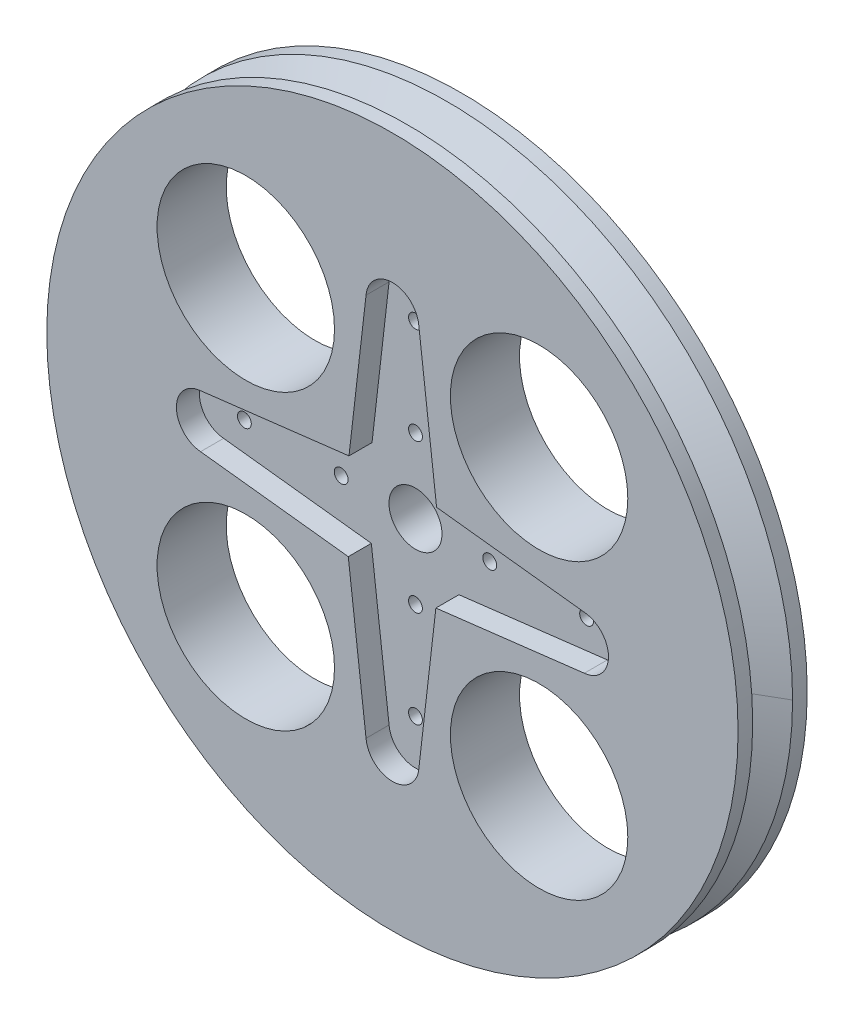
ISO-10303-21;
HEADER;
FILE_DESCRIPTION(('STEP AP214'),'2;1');
FILE_NAME('part.step','',(''),(''),'','','');
FILE_SCHEMA(('AUTOMOTIVE_DESIGN { 1 0 10303 214 1 1 1 1 }'));
ENDSEC;
DATA;
#1=APPLICATION_CONTEXT('core data for automotive mechanical design processes');
#2=APPLICATION_PROTOCOL_DEFINITION('international standard','automotive_design',2000,#1);
#3=PRODUCT_CONTEXT('',#1,'mechanical');
#4=PRODUCT('Part','Part','',(#3));
#5=PRODUCT_RELATED_PRODUCT_CATEGORY('part','',(#4));
#6=PRODUCT_DEFINITION_FORMATION('','',#4);
#7=PRODUCT_DEFINITION_CONTEXT('part definition',#1,'design');
#8=PRODUCT_DEFINITION('design','',#6,#7);
#9=PRODUCT_DEFINITION_SHAPE('','',#8);
#10=(LENGTH_UNIT() NAMED_UNIT(*) SI_UNIT(.MILLI.,.METRE.));
#11=(NAMED_UNIT(*) PLANE_ANGLE_UNIT() SI_UNIT($,.RADIAN.));
#12=(NAMED_UNIT(*) SI_UNIT($,.STERADIAN.) SOLID_ANGLE_UNIT());
#13=UNCERTAINTY_MEASURE_WITH_UNIT(LENGTH_MEASURE(1.E-05),#10,'distance_accuracy_value','');
#14=(GEOMETRIC_REPRESENTATION_CONTEXT(3) GLOBAL_UNCERTAINTY_ASSIGNED_CONTEXT((#13)) GLOBAL_UNIT_ASSIGNED_CONTEXT((#10,
#11,#12)) REPRESENTATION_CONTEXT('',''));
#15=CARTESIAN_POINT('',(0.,0.,0.));
#16=DIRECTION('',(0.,0.,1.));
#17=DIRECTION('',(1.,0.,0.));
#18=AXIS2_PLACEMENT_3D('',#15,#16,#17);
#19=CARTESIAN_POINT('',(0.,0.,-6.));
#20=DIRECTION('',(0.,0.,1.));
#21=DIRECTION('',(1.,0.,0.));
#22=AXIS2_PLACEMENT_3D('',#19,#20,#21);
#23=CYLINDRICAL_SURFACE('',#22,2.30000000000001);
#24=CARTESIAN_POINT('',(0.,0.,-6.));
#25=DIRECTION('',(0.,0.,1.));
#26=DIRECTION('',(1.,0.,0.));
#27=AXIS2_PLACEMENT_3D('',#24,#25,#26);
#28=CIRCLE('',#27,2.30000000000001);
#29=CARTESIAN_POINT('',(2.30000000000002,0.,-6.));
#30=VERTEX_POINT('',#29);
#31=EDGE_CURVE('E324',#30,#30,#28,.T.);
#32=ORIENTED_EDGE('',*,*,#31,.F.);
#33=EDGE_LOOP('',(#32));
#34=FACE_BOUND('',#33,.T.);
#35=CARTESIAN_POINT('',(0.,0.,-2.));
#36=DIRECTION('',(0.,0.,1.));
#37=DIRECTION('',(1.,0.,0.));
#38=AXIS2_PLACEMENT_3D('',#35,#36,#37);
#39=CIRCLE('',#38,2.30000000000001);
#40=CARTESIAN_POINT('',(2.30000000000002,0.,-2.));
#41=VERTEX_POINT('',#40);
#42=EDGE_CURVE('E268',#41,#41,#39,.F.);
#43=ORIENTED_EDGE('',*,*,#42,.F.);
#44=EDGE_LOOP('',(#43));
#45=FACE_BOUND('',#44,.T.);
#46=ADVANCED_FACE('F36',(#34,#45),#23,.F.);
#47=CARTESIAN_POINT('',(-14.85,0.,-6.));
#48=DIRECTION('',(0.,0.,1.));
#49=DIRECTION('',(1.,0.,0.));
#50=AXIS2_PLACEMENT_3D('',#47,#48,#49);
#51=CYLINDRICAL_SURFACE('',#50,0.600000000000013);
#52=CARTESIAN_POINT('',(-14.85,0.,-6.));
#53=DIRECTION('',(0.,0.,1.));
#54=DIRECTION('',(1.,0.,0.));
#55=AXIS2_PLACEMENT_3D('',#52,#53,#54);
#56=CIRCLE('',#55,0.600000000000013);
#57=CARTESIAN_POINT('',(-14.25,0.,-6.));
#58=VERTEX_POINT('',#57);
#59=EDGE_CURVE('E305',#58,#58,#56,.T.);
#60=ORIENTED_EDGE('',*,*,#59,.F.);
#61=EDGE_LOOP('',(#60));
#62=FACE_BOUND('',#61,.T.);
#63=CARTESIAN_POINT('',(-14.85,0.,-2.));
#64=DIRECTION('',(0.,0.,1.));
#65=DIRECTION('',(1.,0.,0.));
#66=AXIS2_PLACEMENT_3D('',#63,#64,#65);
#67=CIRCLE('',#66,0.600000000000013);
#68=CARTESIAN_POINT('',(-14.25,0.,-2.));
#69=VERTEX_POINT('',#68);
#70=EDGE_CURVE('E265',#69,#69,#67,.F.);
#71=ORIENTED_EDGE('',*,*,#70,.F.);
#72=EDGE_LOOP('',(#71));
#73=FACE_BOUND('',#72,.T.);
#74=ADVANCED_FACE('F375',(#62,#73),#51,.F.);
#75=CARTESIAN_POINT('',(6.45,0.,-6.));
#76=DIRECTION('',(0.,0.,1.));
#77=DIRECTION('',(1.,0.,0.));
#78=AXIS2_PLACEMENT_3D('',#75,#76,#77);
#79=CYLINDRICAL_SURFACE('',#78,0.600000000000014);
#80=CARTESIAN_POINT('',(6.45,0.,-6.));
#81=DIRECTION('',(0.,0.,1.));
#82=DIRECTION('',(1.,0.,0.));
#83=AXIS2_PLACEMENT_3D('',#80,#81,#82);
#84=CIRCLE('',#83,0.600000000000014);
#85=CARTESIAN_POINT('',(7.05000000000002,0.,-6.));
#86=VERTEX_POINT('',#85);
#87=EDGE_CURVE('E302',#86,#86,#84,.T.);
#88=ORIENTED_EDGE('',*,*,#87,.F.);
#89=EDGE_LOOP('',(#88));
#90=FACE_BOUND('',#89,.T.);
#91=CARTESIAN_POINT('',(6.45,0.,-2.));
#92=DIRECTION('',(0.,0.,1.));
#93=DIRECTION('',(1.,0.,0.));
#94=AXIS2_PLACEMENT_3D('',#91,#92,#93);
#95=CIRCLE('',#94,0.600000000000014);
#96=CARTESIAN_POINT('',(7.05000000000002,0.,-2.));
#97=VERTEX_POINT('',#96);
#98=EDGE_CURVE('E262',#97,#97,#95,.F.);
#99=ORIENTED_EDGE('',*,*,#98,.F.);
#100=EDGE_LOOP('',(#99));
#101=FACE_BOUND('',#100,.T.);
#102=ADVANCED_FACE('F382',(#90,#101),#79,.F.);
#103=CARTESIAN_POINT('',(0.,-6.45,-6.));
#104=DIRECTION('',(0.,0.,1.));
#105=DIRECTION('',(1.,0.,0.));
#106=AXIS2_PLACEMENT_3D('',#103,#104,#105);
#107=CYLINDRICAL_SURFACE('',#106,0.600000000000014);
#108=CARTESIAN_POINT('',(0.,-6.45,-6.));
#109=DIRECTION('',(0.,0.,1.));
#110=DIRECTION('',(1.,0.,0.));
#111=AXIS2_PLACEMENT_3D('',#108,#109,#110);
#112=CIRCLE('',#111,0.600000000000014);
#113=CARTESIAN_POINT('',(0.599999999999992,-6.45,-6.));
#114=VERTEX_POINT('',#113);
#115=EDGE_CURVE('E299',#114,#114,#112,.T.);
#116=ORIENTED_EDGE('',*,*,#115,.F.);
#117=EDGE_LOOP('',(#116));
#118=FACE_BOUND('',#117,.T.);
#119=CARTESIAN_POINT('',(0.,-6.45,-2.));
#120=DIRECTION('',(0.,0.,1.));
#121=DIRECTION('',(1.,0.,0.));
#122=AXIS2_PLACEMENT_3D('',#119,#120,#121);
#123=CIRCLE('',#122,0.600000000000014);
#124=CARTESIAN_POINT('',(0.599999999999992,-6.45,-2.));
#125=VERTEX_POINT('',#124);
#126=EDGE_CURVE('E259',#125,#125,#123,.F.);
#127=ORIENTED_EDGE('',*,*,#126,.F.);
#128=EDGE_LOOP('',(#127));
#129=FACE_BOUND('',#128,.T.);
#130=ADVANCED_FACE('F427',(#118,#129),#107,.F.);
#131=CARTESIAN_POINT('',(-6.45,0.,-6.));
#132=DIRECTION('',(0.,0.,1.));
#133=DIRECTION('',(1.,0.,0.));
#134=AXIS2_PLACEMENT_3D('',#131,#132,#133);
#135=CYLINDRICAL_SURFACE('',#134,0.600000000000014);
#136=CARTESIAN_POINT('',(-6.45,0.,-6.));
#137=DIRECTION('',(0.,0.,1.));
#138=DIRECTION('',(1.,0.,0.));
#139=AXIS2_PLACEMENT_3D('',#136,#137,#138);
#140=CIRCLE('',#139,0.600000000000014);
#141=CARTESIAN_POINT('',(-5.84999999999999,0.,-6.));
#142=VERTEX_POINT('',#141);
#143=EDGE_CURVE('E296',#142,#142,#140,.T.);
#144=ORIENTED_EDGE('',*,*,#143,.F.);
#145=EDGE_LOOP('',(#144));
#146=FACE_BOUND('',#145,.T.);
#147=CARTESIAN_POINT('',(-6.45,0.,-2.));
#148=DIRECTION('',(0.,0.,1.));
#149=DIRECTION('',(1.,0.,0.));
#150=AXIS2_PLACEMENT_3D('',#147,#148,#149);
#151=CIRCLE('',#150,0.600000000000014);
#152=CARTESIAN_POINT('',(-5.84999999999999,0.,-2.));
#153=VERTEX_POINT('',#152);
#154=EDGE_CURVE('E256',#153,#153,#151,.F.);
#155=ORIENTED_EDGE('',*,*,#154,.F.);
#156=EDGE_LOOP('',(#155));
#157=FACE_BOUND('',#156,.T.);
#158=ADVANCED_FACE('F431',(#146,#157),#135,.F.);
#159=CARTESIAN_POINT('',(0.,6.45,-6.));
#160=DIRECTION('',(0.,0.,1.));
#161=DIRECTION('',(1.,0.,0.));
#162=AXIS2_PLACEMENT_3D('',#159,#160,#161);
#163=CYLINDRICAL_SURFACE('',#162,0.600000000000014);
#164=CARTESIAN_POINT('',(0.,6.45,-6.));
#165=DIRECTION('',(0.,0.,1.));
#166=DIRECTION('',(1.,0.,0.));
#167=AXIS2_PLACEMENT_3D('',#164,#165,#166);
#168=CIRCLE('',#167,0.600000000000014);
#169=CARTESIAN_POINT('',(0.600000000000081,6.45,-6.));
#170=VERTEX_POINT('',#169);
#171=EDGE_CURVE('E293',#170,#170,#168,.T.);
#172=ORIENTED_EDGE('',*,*,#171,.F.);
#173=EDGE_LOOP('',(#172));
#174=FACE_BOUND('',#173,.T.);
#175=CARTESIAN_POINT('',(0.,6.45,-2.));
#176=DIRECTION('',(0.,0.,1.));
#177=DIRECTION('',(1.,0.,0.));
#178=AXIS2_PLACEMENT_3D('',#175,#176,#177);
#179=CIRCLE('',#178,0.600000000000014);
#180=CARTESIAN_POINT('',(0.600000000000081,6.45,-2.));
#181=VERTEX_POINT('',#180);
#182=EDGE_CURVE('E253',#181,#181,#179,.F.);
#183=ORIENTED_EDGE('',*,*,#182,.F.);
#184=EDGE_LOOP('',(#183));
#185=FACE_BOUND('',#184,.T.);
#186=ADVANCED_FACE('F435',(#174,#185),#163,.F.);
#187=CARTESIAN_POINT('',(0.,14.85,-6.));
#188=DIRECTION('',(0.,0.,1.));
#189=DIRECTION('',(1.,0.,0.));
#190=AXIS2_PLACEMENT_3D('',#187,#188,#189);
#191=CYLINDRICAL_SURFACE('',#190,0.600000000000012);
#192=CARTESIAN_POINT('',(0.,14.85,-6.));
#193=DIRECTION('',(0.,0.,1.));
#194=DIRECTION('',(1.,0.,0.));
#195=AXIS2_PLACEMENT_3D('',#192,#193,#194);
#196=CIRCLE('',#195,0.600000000000012);
#197=CARTESIAN_POINT('',(0.600000000000064,14.85,-6.));
#198=VERTEX_POINT('',#197);
#199=EDGE_CURVE('E290',#198,#198,#196,.T.);
#200=ORIENTED_EDGE('',*,*,#199,.F.);
#201=EDGE_LOOP('',(#200));
#202=FACE_BOUND('',#201,.T.);
#203=CARTESIAN_POINT('',(0.,14.85,-2.));
#204=DIRECTION('',(0.,0.,1.));
#205=DIRECTION('',(1.,0.,0.));
#206=AXIS2_PLACEMENT_3D('',#203,#204,#205);
#207=CIRCLE('',#206,0.600000000000012);
#208=CARTESIAN_POINT('',(0.600000000000064,14.85,-2.));
#209=VERTEX_POINT('',#208);
#210=EDGE_CURVE('E250',#209,#209,#207,.F.);
#211=ORIENTED_EDGE('',*,*,#210,.F.);
#212=EDGE_LOOP('',(#211));
#213=FACE_BOUND('',#212,.T.);
#214=ADVANCED_FACE('F439',(#202,#213),#191,.F.);
#215=CARTESIAN_POINT('',(14.85,-1.03696995763641E-13,-6.));
#216=DIRECTION('',(0.,0.,1.));
#217=DIRECTION('',(1.,0.,0.));
#218=AXIS2_PLACEMENT_3D('',#215,#216,#217);
#219=CYLINDRICAL_SURFACE('',#218,0.600000000000014);
#220=CARTESIAN_POINT('',(14.85,-1.03696995763641E-13,-6.));
#221=DIRECTION('',(0.,0.,1.));
#222=DIRECTION('',(1.,0.,0.));
#223=AXIS2_PLACEMENT_3D('',#220,#221,#222);
#224=CIRCLE('',#223,0.600000000000014);
#225=CARTESIAN_POINT('',(15.45,-1.03696995763641E-13,-6.));
#226=VERTEX_POINT('',#225);
#227=EDGE_CURVE('E287',#226,#226,#224,.T.);
#228=ORIENTED_EDGE('',*,*,#227,.F.);
#229=EDGE_LOOP('',(#228));
#230=FACE_BOUND('',#229,.T.);
#231=CARTESIAN_POINT('',(14.85,-1.03696995763641E-13,-2.));
#232=DIRECTION('',(0.,0.,1.));
#233=DIRECTION('',(1.,0.,0.));
#234=AXIS2_PLACEMENT_3D('',#231,#232,#233);
#235=CIRCLE('',#234,0.600000000000014);
#236=CARTESIAN_POINT('',(15.45,-1.03696995763641E-13,-2.));
#237=VERTEX_POINT('',#236);
#238=EDGE_CURVE('E247',#237,#237,#235,.F.);
#239=ORIENTED_EDGE('',*,*,#238,.F.);
#240=EDGE_LOOP('',(#239));
#241=FACE_BOUND('',#240,.T.);
#242=ADVANCED_FACE('F443',(#230,#241),#219,.F.);
#243=CARTESIAN_POINT('',(-1.55545493645462E-13,-14.85,-6.));
#244=DIRECTION('',(0.,0.,1.));
#245=DIRECTION('',(1.,0.,0.));
#246=AXIS2_PLACEMENT_3D('',#243,#244,#245);
#247=CYLINDRICAL_SURFACE('',#246,0.600000000000013);
#248=CARTESIAN_POINT('',(-1.55545493645462E-13,-14.85,-6.));
#249=DIRECTION('',(0.,0.,1.));
#250=DIRECTION('',(1.,0.,0.));
#251=AXIS2_PLACEMENT_3D('',#248,#249,#250);
#252=CIRCLE('',#251,0.600000000000013);
#253=CARTESIAN_POINT('',(0.599999999999857,-14.85,-6.));
#254=VERTEX_POINT('',#253);
#255=EDGE_CURVE('E281',#254,#254,#252,.T.);
#256=ORIENTED_EDGE('',*,*,#255,.F.);
#257=EDGE_LOOP('',(#256));
#258=FACE_BOUND('',#257,.T.);
#259=CARTESIAN_POINT('',(-1.55545493645462E-13,-14.85,-2.));
#260=DIRECTION('',(0.,0.,1.));
#261=DIRECTION('',(1.,0.,0.));
#262=AXIS2_PLACEMENT_3D('',#259,#260,#261);
#263=CIRCLE('',#262,0.600000000000013);
#264=CARTESIAN_POINT('',(0.599999999999857,-14.85,-2.));
#265=VERTEX_POINT('',#264);
#266=EDGE_CURVE('E40',#265,#265,#263,.F.);
#267=ORIENTED_EDGE('',*,*,#266,.F.);
#268=EDGE_LOOP('',(#267));
#269=FACE_BOUND('',#268,.T.);
#270=ADVANCED_FACE('F358',(#258,#269),#247,.F.);
#271=CARTESIAN_POINT('',(0.,0.,-6.));
#272=DIRECTION('',(0.,0.,1.));
#273=DIRECTION('',(1.,0.,0.));
#274=AXIS2_PLACEMENT_3D('',#271,#272,#273);
#275=CYLINDRICAL_SURFACE('',#274,30.);
#276=CARTESIAN_POINT('',(0.,0.,-4.7320508075689));
#277=DIRECTION('',(0.,0.,-1.));
#278=DIRECTION('',(-1.,0.,0.));
#279=AXIS2_PLACEMENT_3D('',#276,#277,#278);
#280=CIRCLE('',#279,30.);
#281=CARTESIAN_POINT('',(-30.,0.,-4.73205080756889));
#282=VERTEX_POINT('',#281);
#283=CARTESIAN_POINT('',(30.,0.,-4.73205080756889));
#284=VERTEX_POINT('',#283);
#285=EDGE_CURVE('E11',#282,#284,#280,.F.);
#286=ORIENTED_EDGE('',*,*,#285,.F.);
#287=CARTESIAN_POINT('',(0.,0.,-4.73205080756889));
#288=DIRECTION('',(0.,0.,-1.));
#289=DIRECTION('',(-1.,0.,0.));
#290=AXIS2_PLACEMENT_3D('',#287,#288,#289);
#291=CIRCLE('',#290,30.);
#292=EDGE_CURVE('E45',#284,#282,#291,.F.);
#293=ORIENTED_EDGE('',*,*,#292,.F.);
#294=EDGE_LOOP('',(#286,#293));
#295=FACE_BOUND('',#294,.T.);
#296=CARTESIAN_POINT('',(0.,0.,-6.));
#297=DIRECTION('',(0.,0.,1.));
#298=DIRECTION('',(1.,0.,0.));
#299=AXIS2_PLACEMENT_3D('',#296,#297,#298);
#300=CIRCLE('',#299,30.);
#301=CARTESIAN_POINT('',(30.,0.,-6.));
#302=VERTEX_POINT('',#301);
#303=EDGE_CURVE('E336',#302,#302,#300,.T.);
#304=ORIENTED_EDGE('',*,*,#303,.T.);
#305=EDGE_LOOP('',(#304));
#306=FACE_BOUND('',#305,.T.);
#307=ADVANCED_FACE('F355',(#295,#306),#275,.T.);
#308=CARTESIAN_POINT('',(0.,0.,-1.2679491924311));
#309=DIRECTION('',(0.,0.,1.));
#310=DIRECTION('',(1.,0.,0.));
#311=AXIS2_PLACEMENT_3D('',#308,#309,#310);
#312=CIRCLE('',#311,30.);
#313=CARTESIAN_POINT('',(30.,0.,-1.2679491924311));
#314=VERTEX_POINT('',#313);
#315=CARTESIAN_POINT('',(-30.,0.,-1.2679491924311));
#316=VERTEX_POINT('',#315);
#317=EDGE_CURVE('E343',#314,#316,#312,.F.);
#318=ORIENTED_EDGE('',*,*,#317,.F.);
#319=CARTESIAN_POINT('',(0.,0.,-1.2679491924311));
#320=DIRECTION('',(0.,0.,1.));
#321=DIRECTION('',(1.,0.,0.));
#322=AXIS2_PLACEMENT_3D('',#319,#320,#321);
#323=CIRCLE('',#322,30.);
#324=EDGE_CURVE('E339',#316,#314,#323,.F.);
#325=ORIENTED_EDGE('',*,*,#324,.F.);
#326=EDGE_LOOP('',(#318,#325));
#327=FACE_BOUND('',#326,.T.);
#328=CARTESIAN_POINT('',(0.,0.,0.));
#329=DIRECTION('',(0.,0.,1.));
#330=DIRECTION('',(1.,0.,0.));
#331=AXIS2_PLACEMENT_3D('',#328,#329,#330);
#332=CIRCLE('',#331,30.);
#333=CARTESIAN_POINT('',(30.,0.,0.));
#334=VERTEX_POINT('',#333);
#335=EDGE_CURVE('E333',#334,#334,#332,.T.);
#336=ORIENTED_EDGE('',*,*,#335,.F.);
#337=EDGE_LOOP('',(#336));
#338=FACE_BOUND('',#337,.T.);
#339=ADVANCED_FACE('F38',(#327,#338),#275,.T.);
#340=CARTESIAN_POINT('',(0.,0.,-6.));
#341=DIRECTION('',(0.,0.,1.));
#342=DIRECTION('',(1.,0.,0.));
#343=AXIS2_PLACEMENT_3D('',#340,#341,#342);
#344=PLANE('',#343);
#345=ORIENTED_EDGE('',*,*,#255,.T.);
#346=EDGE_LOOP('',(#345));
#347=FACE_BOUND('',#346,.T.);
#348=ORIENTED_EDGE('',*,*,#227,.T.);
#349=EDGE_LOOP('',(#348));
#350=FACE_BOUND('',#349,.T.);
#351=ORIENTED_EDGE('',*,*,#199,.T.);
#352=EDGE_LOOP('',(#351));
#353=FACE_BOUND('',#352,.T.);
#354=ORIENTED_EDGE('',*,*,#171,.T.);
#355=EDGE_LOOP('',(#354));
#356=FACE_BOUND('',#355,.T.);
#357=ORIENTED_EDGE('',*,*,#143,.T.);
#358=EDGE_LOOP('',(#357));
#359=FACE_BOUND('',#358,.T.);
#360=ORIENTED_EDGE('',*,*,#115,.T.);
#361=EDGE_LOOP('',(#360));
#362=FACE_BOUND('',#361,.T.);
#363=ORIENTED_EDGE('',*,*,#87,.T.);
#364=EDGE_LOOP('',(#363));
#365=FACE_BOUND('',#364,.T.);
#366=ORIENTED_EDGE('',*,*,#59,.T.);
#367=EDGE_LOOP('',(#366));
#368=FACE_BOUND('',#367,.T.);
#369=CARTESIAN_POINT('',(-12.7279220613571,-12.7279220613579,-6.));
#370=DIRECTION('',(0.,0.,1.));
#371=DIRECTION('',(1.,0.,0.));
#372=AXIS2_PLACEMENT_3D('',#369,#370,#371);
#373=CIRCLE('',#372,7.70000000000038);
#374=CARTESIAN_POINT('',(-5.02792206135669,-12.7279220613579,-6.));
#375=VERTEX_POINT('',#374);
#376=EDGE_CURVE('E309',#375,#375,#373,.T.);
#377=ORIENTED_EDGE('',*,*,#376,.T.);
#378=EDGE_LOOP('',(#377));
#379=FACE_BOUND('',#378,.T.);
#380=CARTESIAN_POINT('',(12.7279220613586,-12.7279220613571,-6.));
#381=DIRECTION('',(0.,0.,1.));
#382=DIRECTION('',(1.,0.,0.));
#383=AXIS2_PLACEMENT_3D('',#380,#381,#382);
#384=CIRCLE('',#383,7.70000000000101);
#385=CARTESIAN_POINT('',(20.4279220613596,-12.7279220613571,-6.));
#386=VERTEX_POINT('',#385);
#387=EDGE_CURVE('E315',#386,#386,#384,.T.);
#388=ORIENTED_EDGE('',*,*,#387,.T.);
#389=EDGE_LOOP('',(#388));
#390=FACE_BOUND('',#389,.T.);
#391=CARTESIAN_POINT('',(12.7279220613578,12.7279220613586,-6.));
#392=DIRECTION('',(0.,0.,1.));
#393=DIRECTION('',(1.,0.,0.));
#394=AXIS2_PLACEMENT_3D('',#391,#392,#393);
#395=CIRCLE('',#394,7.70000000000074);
#396=CARTESIAN_POINT('',(20.4279220613585,12.7279220613586,-6.));
#397=VERTEX_POINT('',#396);
#398=EDGE_CURVE('E321',#397,#397,#395,.T.);
#399=ORIENTED_EDGE('',*,*,#398,.T.);
#400=EDGE_LOOP('',(#399));
#401=FACE_BOUND('',#400,.T.);
#402=ORIENTED_EDGE('',*,*,#31,.T.);
#403=EDGE_LOOP('',(#402));
#404=FACE_BOUND('',#403,.T.);
#405=CARTESIAN_POINT('',(-12.7279220613579,12.7279220613578,-6.));
#406=DIRECTION('',(0.,0.,1.));
#407=DIRECTION('',(1.,0.,0.));
#408=AXIS2_PLACEMENT_3D('',#405,#406,#407);
#409=CIRCLE('',#408,7.7);
#410=CARTESIAN_POINT('',(-5.02792206135792,12.7279220613578,-6.));
#411=VERTEX_POINT('',#410);
#412=EDGE_CURVE('E330',#411,#411,#409,.T.);
#413=ORIENTED_EDGE('',*,*,#412,.T.);
#414=EDGE_LOOP('',(#413));
#415=FACE_BOUND('',#414,.T.);
#416=ORIENTED_EDGE('',*,*,#303,.F.);
#417=EDGE_LOOP('',(#416));
#418=FACE_BOUND('',#417,.T.);
#419=ADVANCED_FACE('F361',(#347,#350,#353,#356,#359,#362,#365,#368,#379,#390,#401,#404,#415,
#418),#344,.F.);
#420=CARTESIAN_POINT('',(0.,0.,0.));
#421=DIRECTION('',(0.,0.,1.));
#422=DIRECTION('',(1.,0.,0.));
#423=AXIS2_PLACEMENT_3D('',#420,#421,#422);
#424=PLANE('',#423);
#425=DIRECTION('',(-0.114650746476427,-0.993405861837144,0.));
#426=VECTOR('',#425,1.);
#427=CARTESIAN_POINT('',(-2.2910474224194,16.65273556231,0.));
#428=LINE('',#427,#426);
#429=CARTESIAN_POINT('',(-2.2910474224194,16.65273556231,0.));
#430=VERTEX_POINT('',#429);
#431=CARTESIAN_POINT('',(-3.77072375087373,3.83189327838807,0.));
#432=VERTEX_POINT('',#431);
#433=EDGE_CURVE('E52',#430,#432,#428,.T.);
#434=ORIENTED_EDGE('',*,*,#433,.F.);
#435=CARTESIAN_POINT('',(0.,16.45,0.));
#436=DIRECTION('',(0.,0.,1.));
#437=DIRECTION('',(1.,0.,0.));
#438=AXIS2_PLACEMENT_3D('',#435,#436,#437);
#439=CIRCLE('',#438,2.3);
#440=CARTESIAN_POINT('',(2.29104742241951,16.65273556231,0.));
#441=VERTEX_POINT('',#440);
#442=EDGE_CURVE('E166',#441,#430,#439,.T.);
#443=ORIENTED_EDGE('',*,*,#442,.F.);
#444=DIRECTION('',(-0.118765629011359,0.992922315876492,0.));
#445=VECTOR('',#444,1.);
#446=CARTESIAN_POINT('',(3.83189327838807,3.77072375087373,0.));
#447=LINE('',#446,#445);
#448=CARTESIAN_POINT('',(3.83189327838807,3.77072375087373,0.));
#449=VERTEX_POINT('',#448);
#450=EDGE_CURVE('E169',#449,#441,#447,.T.);
#451=ORIENTED_EDGE('',*,*,#450,.F.);
#452=DIRECTION('',(-0.993405861837143,0.114650746476431,0.));
#453=VECTOR('',#452,1.);
#454=CARTESIAN_POINT('',(16.6527355623101,2.29104742241934,0.));
#455=LINE('',#454,#453);
#456=CARTESIAN_POINT('',(16.6527355623101,2.29104742241934,0.));
#457=VERTEX_POINT('',#456);
#458=EDGE_CURVE('E221',#457,#449,#455,.T.);
#459=ORIENTED_EDGE('',*,*,#458,.F.);
#460=CARTESIAN_POINT('',(16.45,-1.14491749414469E-13,0.));
#461=DIRECTION('',(0.,0.,1.));
#462=DIRECTION('',(1.,0.,0.));
#463=AXIS2_PLACEMENT_3D('',#460,#461,#462);
#464=CIRCLE('',#463,2.3);
#465=CARTESIAN_POINT('',(16.65273556231,-2.29104742241957,0.));
#466=VERTEX_POINT('',#465);
#467=EDGE_CURVE('E218',#466,#457,#464,.T.);
#468=ORIENTED_EDGE('',*,*,#467,.F.);
#469=DIRECTION('',(0.992922315876492,0.118765629011355,0.));
#470=VECTOR('',#469,1.);
#471=CARTESIAN_POINT('',(3.77072375087373,-3.83189327838807,0.));
#472=LINE('',#471,#470);
#473=CARTESIAN_POINT('',(3.77072375087373,-3.83189327838807,0.));
#474=VERTEX_POINT('',#473);
#475=EDGE_CURVE('E215',#474,#466,#472,.T.);
#476=ORIENTED_EDGE('',*,*,#475,.F.);
#477=DIRECTION('',(0.114650746476436,0.993405861837143,0.));
#478=VECTOR('',#477,1.);
#479=CARTESIAN_POINT('',(2.29104742241928,-16.6527355623101,0.));
#480=LINE('',#479,#478);
#481=CARTESIAN_POINT('',(2.29104742241928,-16.6527355623101,0.));
#482=VERTEX_POINT('',#481);
#483=EDGE_CURVE('E212',#482,#474,#480,.T.);
#484=ORIENTED_EDGE('',*,*,#483,.F.);
#485=CARTESIAN_POINT('',(-1.72604985859692E-13,-16.45,0.));
#486=DIRECTION('',(0.,0.,1.));
#487=DIRECTION('',(1.,0.,0.));
#488=AXIS2_PLACEMENT_3D('',#485,#486,#487);
#489=CIRCLE('',#488,2.3);
#490=CARTESIAN_POINT('',(-2.29104742241963,-16.65273556231,0.));
#491=VERTEX_POINT('',#490);
#492=EDGE_CURVE('E209',#491,#482,#489,.T.);
#493=ORIENTED_EDGE('',*,*,#492,.F.);
#494=DIRECTION('',(0.11876562901135,-0.992922315876493,0.));
#495=VECTOR('',#494,1.);
#496=CARTESIAN_POINT('',(-3.83189327838807,-3.77072375087373,0.));
#497=LINE('',#496,#495);
#498=CARTESIAN_POINT('',(-3.83189327838807,-3.77072375087373,0.));
#499=VERTEX_POINT('',#498);
#500=EDGE_CURVE('E206',#499,#491,#497,.T.);
#501=ORIENTED_EDGE('',*,*,#500,.F.);
#502=DIRECTION('',(0.993405861837144,-0.114650746476423,0.));
#503=VECTOR('',#502,1.);
#504=CARTESIAN_POINT('',(-16.65273556231,-2.29104742241946,0.));
#505=LINE('',#504,#503);
#506=CARTESIAN_POINT('',(-16.65273556231,-2.29104742241946,0.));
#507=VERTEX_POINT('',#506);
#508=EDGE_CURVE('E203',#507,#499,#505,.T.);
#509=ORIENTED_EDGE('',*,*,#508,.F.);
#510=CARTESIAN_POINT('',(-16.45,0.,0.));
#511=DIRECTION('',(0.,0.,1.));
#512=DIRECTION('',(1.,0.,0.));
#513=AXIS2_PLACEMENT_3D('',#510,#511,#512);
#514=CIRCLE('',#513,2.3);
#515=CARTESIAN_POINT('',(-16.65273556231,2.29104742241946,0.));
#516=VERTEX_POINT('',#515);
#517=EDGE_CURVE('E200',#516,#507,#514,.T.);
#518=ORIENTED_EDGE('',*,*,#517,.F.);
#519=DIRECTION('',(-0.992922315876492,-0.118765629011363,0.));
#520=VECTOR('',#519,1.);
#521=CARTESIAN_POINT('',(-3.77072375087373,3.83189327838807,0.));
#522=LINE('',#521,#520);
#523=EDGE_CURVE('E198',#432,#516,#522,.T.);
#524=ORIENTED_EDGE('',*,*,#523,.F.);
#525=EDGE_LOOP('',(#434,#443,#451,#459,#468,#476,#484,#493,#501,#509,#518,#524));
#526=FACE_BOUND('',#525,.T.);
#527=CARTESIAN_POINT('',(-12.7279220613571,-12.7279220613579,0.));
#528=DIRECTION('',(0.,0.,1.));
#529=DIRECTION('',(1.,0.,0.));
#530=AXIS2_PLACEMENT_3D('',#527,#528,#529);
#531=CIRCLE('',#530,7.70000000000038);
#532=CARTESIAN_POINT('',(-5.02792206135669,-12.7279220613579,0.));
#533=VERTEX_POINT('',#532);
#534=EDGE_CURVE('E308',#533,#533,#531,.T.);
#535=ORIENTED_EDGE('',*,*,#534,.F.);
#536=EDGE_LOOP('',(#535));
#537=FACE_BOUND('',#536,.T.);
#538=CARTESIAN_POINT('',(12.7279220613586,-12.7279220613571,0.));
#539=DIRECTION('',(0.,0.,1.));
#540=DIRECTION('',(1.,0.,0.));
#541=AXIS2_PLACEMENT_3D('',#538,#539,#540);
#542=CIRCLE('',#541,7.70000000000101);
#543=CARTESIAN_POINT('',(20.4279220613596,-12.7279220613571,0.));
#544=VERTEX_POINT('',#543);
#545=EDGE_CURVE('E312',#544,#544,#542,.T.);
#546=ORIENTED_EDGE('',*,*,#545,.F.);
#547=EDGE_LOOP('',(#546));
#548=FACE_BOUND('',#547,.T.);
#549=CARTESIAN_POINT('',(12.7279220613578,12.7279220613586,0.));
#550=DIRECTION('',(0.,0.,1.));
#551=DIRECTION('',(1.,0.,0.));
#552=AXIS2_PLACEMENT_3D('',#549,#550,#551);
#553=CIRCLE('',#552,7.70000000000074);
#554=CARTESIAN_POINT('',(20.4279220613585,12.7279220613586,0.));
#555=VERTEX_POINT('',#554);
#556=EDGE_CURVE('E318',#555,#555,#553,.T.);
#557=ORIENTED_EDGE('',*,*,#556,.F.);
#558=EDGE_LOOP('',(#557));
#559=FACE_BOUND('',#558,.T.);
#560=CARTESIAN_POINT('',(-12.7279220613579,12.7279220613578,0.));
#561=DIRECTION('',(0.,0.,1.));
#562=DIRECTION('',(1.,0.,0.));
#563=AXIS2_PLACEMENT_3D('',#560,#561,#562);
#564=CIRCLE('',#563,7.7);
#565=CARTESIAN_POINT('',(-5.02792206135792,12.7279220613578,0.));
#566=VERTEX_POINT('',#565);
#567=EDGE_CURVE('E329',#566,#566,#564,.T.);
#568=ORIENTED_EDGE('',*,*,#567,.F.);
#569=EDGE_LOOP('',(#568));
#570=FACE_BOUND('',#569,.T.);
#571=ORIENTED_EDGE('',*,*,#335,.T.);
#572=EDGE_LOOP('',(#571));
#573=FACE_BOUND('',#572,.T.);
#574=ADVANCED_FACE('F363',(#526,#537,#548,#559,#570,#573),#424,.T.);
#575=CARTESIAN_POINT('',(-12.7279220613579,12.7279220613578,-6.));
#576=DIRECTION('',(0.,0.,1.));
#577=DIRECTION('',(1.,0.,0.));
#578=AXIS2_PLACEMENT_3D('',#575,#576,#577);
#579=CYLINDRICAL_SURFACE('',#578,7.7);
#580=ORIENTED_EDGE('',*,*,#412,.F.);
#581=EDGE_LOOP('',(#580));
#582=FACE_BOUND('',#581,.T.);
#583=ORIENTED_EDGE('',*,*,#567,.T.);
#584=EDGE_LOOP('',(#583));
#585=FACE_BOUND('',#584,.T.);
#586=ADVANCED_FACE('F368',(#582,#585),#579,.F.);
#587=CARTESIAN_POINT('',(12.7279220613578,12.7279220613586,-6.));
#588=DIRECTION('',(0.,0.,1.));
#589=DIRECTION('',(1.,0.,0.));
#590=AXIS2_PLACEMENT_3D('',#587,#588,#589);
#591=CYLINDRICAL_SURFACE('',#590,7.70000000000074);
#592=ORIENTED_EDGE('',*,*,#398,.F.);
#593=EDGE_LOOP('',(#592));
#594=FACE_BOUND('',#593,.T.);
#595=ORIENTED_EDGE('',*,*,#556,.T.);
#596=EDGE_LOOP('',(#595));
#597=FACE_BOUND('',#596,.T.);
#598=ADVANCED_FACE('F388',(#594,#597),#591,.F.);
#599=CARTESIAN_POINT('',(12.7279220613586,-12.7279220613571,-6.));
#600=DIRECTION('',(0.,0.,1.));
#601=DIRECTION('',(1.,0.,0.));
#602=AXIS2_PLACEMENT_3D('',#599,#600,#601);
#603=CYLINDRICAL_SURFACE('',#602,7.70000000000101);
#604=ORIENTED_EDGE('',*,*,#387,.F.);
#605=EDGE_LOOP('',(#604));
#606=FACE_BOUND('',#605,.T.);
#607=ORIENTED_EDGE('',*,*,#545,.T.);
#608=EDGE_LOOP('',(#607));
#609=FACE_BOUND('',#608,.T.);
#610=ADVANCED_FACE('F396',(#606,#609),#603,.F.);
#611=CARTESIAN_POINT('',(-12.7279220613571,-12.7279220613579,-6.));
#612=DIRECTION('',(0.,0.,1.));
#613=DIRECTION('',(1.,0.,0.));
#614=AXIS2_PLACEMENT_3D('',#611,#612,#613);
#615=CYLINDRICAL_SURFACE('',#614,7.70000000000038);
#616=ORIENTED_EDGE('',*,*,#376,.F.);
#617=EDGE_LOOP('',(#616));
#618=FACE_BOUND('',#617,.T.);
#619=ORIENTED_EDGE('',*,*,#534,.T.);
#620=EDGE_LOOP('',(#619));
#621=FACE_BOUND('',#620,.T.);
#622=ADVANCED_FACE('F409',(#618,#621),#615,.F.);
#623=CARTESIAN_POINT('',(0.,0.,-3.));
#624=DIRECTION('',(0.,0.,-1.));
#625=DIRECTION('',(-1.,0.,0.));
#626=AXIS2_PLACEMENT_3D('',#623,#624,#625);
#627=CONICAL_SURFACE('',#626,27.,1.04719755119659);
#628=ORIENTED_EDGE('',*,*,#285,.T.);
#629=DIRECTION('',(0.866025403784436,0.,-0.500000000000004));
#630=VECTOR('',#629,1.);
#631=CARTESIAN_POINT('',(27.,0.,-3.));
#632=LINE('',#631,#630);
#633=CARTESIAN_POINT('',(27.,0.,-3.));
#634=VERTEX_POINT('',#633);
#635=EDGE_CURVE('E60',#634,#284,#632,.T.);
#636=ORIENTED_EDGE('',*,*,#635,.F.);
#637=CARTESIAN_POINT('',(0.,0.,-3.));
#638=DIRECTION('',(0.,0.,-1.));
#639=DIRECTION('',(1.,0.,0.));
#640=AXIS2_PLACEMENT_3D('',#637,#638,#639);
#641=CIRCLE('',#640,27.);
#642=CARTESIAN_POINT('',(-27.,0.,-3.));
#643=VERTEX_POINT('',#642);
#644=EDGE_CURVE('E278',#634,#643,#641,.T.);
#645=ORIENTED_EDGE('',*,*,#644,.T.);
#646=DIRECTION('',(-0.866025403784436,0.,-0.500000000000004));
#647=VECTOR('',#646,1.);
#648=CARTESIAN_POINT('',(-27.,0.,-3.));
#649=LINE('',#648,#647);
#650=EDGE_CURVE('E273',#643,#282,#649,.T.);
#651=ORIENTED_EDGE('',*,*,#650,.T.);
#652=EDGE_LOOP('',(#628,#636,#645,#651));
#653=FACE_BOUND('',#652,.T.);
#654=ADVANCED_FACE('F352',(#653),#627,.T.);
#655=CARTESIAN_POINT('',(0.,0.,-0.599999999999999));
#656=DIRECTION('',(0.,0.,1.));
#657=DIRECTION('',(1.,0.,0.));
#658=AXIS2_PLACEMENT_3D('',#655,#656,#657);
#659=CONICAL_SURFACE('',#658,31.1569219381653,1.04719755119659);
#660=ORIENTED_EDGE('',*,*,#317,.T.);
#661=DIRECTION('',(0.866025403784436,0.,-0.500000000000004));
#662=VECTOR('',#661,1.);
#663=CARTESIAN_POINT('',(-31.1569219381653,0.,-0.599999999999999));
#664=LINE('',#663,#662);
#665=EDGE_CURVE('E271',#316,#643,#664,.T.);
#666=ORIENTED_EDGE('',*,*,#665,.T.);
#667=ORIENTED_EDGE('',*,*,#644,.F.);
#668=DIRECTION('',(-0.866025403784436,0.,-0.500000000000004));
#669=VECTOR('',#668,1.);
#670=CARTESIAN_POINT('',(31.1569219381653,0.,-0.599999999999999));
#671=LINE('',#670,#669);
#672=EDGE_CURVE('E274',#314,#634,#671,.T.);
#673=ORIENTED_EDGE('',*,*,#672,.F.);
#674=EDGE_LOOP('',(#660,#666,#667,#673));
#675=FACE_BOUND('',#674,.T.);
#676=ADVANCED_FACE('F453',(#675),#659,.T.);
#677=CARTESIAN_POINT('',(0.,0.,-3.));
#678=DIRECTION('',(0.,0.,-1.));
#679=DIRECTION('',(-1.,0.,0.));
#680=AXIS2_PLACEMENT_3D('',#677,#678,#679);
#681=CONICAL_SURFACE('',#680,27.,1.04719755119659);
#682=ORIENTED_EDGE('',*,*,#292,.T.);
#683=ORIENTED_EDGE('',*,*,#650,.F.);
#684=CARTESIAN_POINT('',(0.,0.,-3.));
#685=DIRECTION('',(0.,0.,-1.));
#686=DIRECTION('',(-1.,0.,0.));
#687=AXIS2_PLACEMENT_3D('',#684,#685,#686);
#688=CIRCLE('',#687,27.);
#689=EDGE_CURVE('E276',#643,#634,#688,.T.);
#690=ORIENTED_EDGE('',*,*,#689,.T.);
#691=ORIENTED_EDGE('',*,*,#635,.T.);
#692=EDGE_LOOP('',(#682,#683,#690,#691));
#693=FACE_BOUND('',#692,.T.);
#694=ADVANCED_FACE('F348',(#693),#681,.T.);
#695=CARTESIAN_POINT('',(0.,0.,-0.599999999999999));
#696=DIRECTION('',(0.,0.,1.));
#697=DIRECTION('',(1.,0.,0.));
#698=AXIS2_PLACEMENT_3D('',#695,#696,#697);
#699=CONICAL_SURFACE('',#698,31.1569219381653,1.04719755119659);
#700=ORIENTED_EDGE('',*,*,#324,.T.);
#701=ORIENTED_EDGE('',*,*,#672,.T.);
#702=ORIENTED_EDGE('',*,*,#689,.F.);
#703=ORIENTED_EDGE('',*,*,#665,.F.);
#704=EDGE_LOOP('',(#700,#701,#702,#703));
#705=FACE_BOUND('',#704,.T.);
#706=ADVANCED_FACE('F456',(#705),#699,.T.);
#707=CARTESIAN_POINT('',(-16.45,0.,-2.));
#708=DIRECTION('',(0.,0.,1.));
#709=DIRECTION('',(1.,0.,0.));
#710=AXIS2_PLACEMENT_3D('',#707,#708,#709);
#711=PLANE('',#710);
#712=DIRECTION('',(-0.114650746476427,-0.993405861837144,0.));
#713=VECTOR('',#712,1.);
#714=CARTESIAN_POINT('',(-2.2910474224194,16.65273556231,-2.));
#715=LINE('',#714,#713);
#716=CARTESIAN_POINT('',(-2.2910474224194,16.65273556231,-2.));
#717=VERTEX_POINT('',#716);
#718=CARTESIAN_POINT('',(-3.77072375087373,3.83189327838807,-2.));
#719=VERTEX_POINT('',#718);
#720=EDGE_CURVE('E146',#717,#719,#715,.T.);
#721=ORIENTED_EDGE('',*,*,#720,.T.);
#722=DIRECTION('',(-0.992922315876492,-0.118765629011363,0.));
#723=VECTOR('',#722,1.);
#724=CARTESIAN_POINT('',(-3.77072375087373,3.83189327838807,-2.));
#725=LINE('',#724,#723);
#726=CARTESIAN_POINT('',(-16.65273556231,2.29104742241946,-2.));
#727=VERTEX_POINT('',#726);
#728=EDGE_CURVE('E155',#719,#727,#725,.T.);
#729=ORIENTED_EDGE('',*,*,#728,.T.);
#730=CARTESIAN_POINT('',(-16.45,0.,-2.));
#731=DIRECTION('',(0.,0.,1.));
#732=DIRECTION('',(1.,0.,0.));
#733=AXIS2_PLACEMENT_3D('',#730,#731,#732);
#734=CIRCLE('',#733,2.3);
#735=CARTESIAN_POINT('',(-16.65273556231,-2.29104742241946,-2.));
#736=VERTEX_POINT('',#735);
#737=EDGE_CURVE('E160',#727,#736,#734,.T.);
#738=ORIENTED_EDGE('',*,*,#737,.T.);
#739=DIRECTION('',(0.993405861837144,-0.114650746476423,0.));
#740=VECTOR('',#739,1.);
#741=CARTESIAN_POINT('',(-16.65273556231,-2.29104742241946,-2.));
#742=LINE('',#741,#740);
#743=CARTESIAN_POINT('',(-3.83189327838807,-3.77072375087373,-2.));
#744=VERTEX_POINT('',#743);
#745=EDGE_CURVE('E173',#736,#744,#742,.T.);
#746=ORIENTED_EDGE('',*,*,#745,.T.);
#747=DIRECTION('',(0.11876562901135,-0.992922315876493,0.));
#748=VECTOR('',#747,1.);
#749=CARTESIAN_POINT('',(-3.83189327838807,-3.77072375087373,-2.));
#750=LINE('',#749,#748);
#751=CARTESIAN_POINT('',(-2.29104742241963,-16.65273556231,-2.));
#752=VERTEX_POINT('',#751);
#753=EDGE_CURVE('E176',#744,#752,#750,.T.);
#754=ORIENTED_EDGE('',*,*,#753,.T.);
#755=CARTESIAN_POINT('',(-1.72604985859692E-13,-16.45,-2.));
#756=DIRECTION('',(0.,0.,1.));
#757=DIRECTION('',(1.,0.,0.));
#758=AXIS2_PLACEMENT_3D('',#755,#756,#757);
#759=CIRCLE('',#758,2.3);
#760=CARTESIAN_POINT('',(2.29104742241928,-16.6527355623101,-2.));
#761=VERTEX_POINT('',#760);
#762=EDGE_CURVE('E179',#752,#761,#759,.T.);
#763=ORIENTED_EDGE('',*,*,#762,.T.);
#764=DIRECTION('',(0.114650746476436,0.993405861837143,0.));
#765=VECTOR('',#764,1.);
#766=CARTESIAN_POINT('',(2.29104742241928,-16.6527355623101,-2.));
#767=LINE('',#766,#765);
#768=CARTESIAN_POINT('',(3.77072375087373,-3.83189327838807,-2.));
#769=VERTEX_POINT('',#768);
#770=EDGE_CURVE('E182',#761,#769,#767,.T.);
#771=ORIENTED_EDGE('',*,*,#770,.T.);
#772=DIRECTION('',(0.992922315876492,0.118765629011355,0.));
#773=VECTOR('',#772,1.);
#774=CARTESIAN_POINT('',(3.77072375087373,-3.83189327838807,-2.));
#775=LINE('',#774,#773);
#776=CARTESIAN_POINT('',(16.65273556231,-2.29104742241957,-2.));
#777=VERTEX_POINT('',#776);
#778=EDGE_CURVE('E185',#769,#777,#775,.T.);
#779=ORIENTED_EDGE('',*,*,#778,.T.);
#780=CARTESIAN_POINT('',(16.45,-1.14491749414469E-13,-2.));
#781=DIRECTION('',(0.,0.,1.));
#782=DIRECTION('',(1.,0.,0.));
#783=AXIS2_PLACEMENT_3D('',#780,#781,#782);
#784=CIRCLE('',#783,2.3);
#785=CARTESIAN_POINT('',(16.6527355623101,2.29104742241934,-2.));
#786=VERTEX_POINT('',#785);
#787=EDGE_CURVE('E188',#777,#786,#784,.T.);
#788=ORIENTED_EDGE('',*,*,#787,.T.);
#789=DIRECTION('',(-0.993405861837143,0.114650746476431,0.));
#790=VECTOR('',#789,1.);
#791=CARTESIAN_POINT('',(16.6527355623101,2.29104742241934,-2.));
#792=LINE('',#791,#790);
#793=CARTESIAN_POINT('',(3.83189327838807,3.77072375087373,-2.));
#794=VERTEX_POINT('',#793);
#795=EDGE_CURVE('E191',#786,#794,#792,.T.);
#796=ORIENTED_EDGE('',*,*,#795,.T.);
#797=DIRECTION('',(-0.118765629011359,0.992922315876492,0.));
#798=VECTOR('',#797,1.);
#799=CARTESIAN_POINT('',(3.83189327838807,3.77072375087373,-2.));
#800=LINE('',#799,#798);
#801=CARTESIAN_POINT('',(2.29104742241951,16.65273556231,-2.));
#802=VERTEX_POINT('',#801);
#803=EDGE_CURVE('E194',#794,#802,#800,.T.);
#804=ORIENTED_EDGE('',*,*,#803,.T.);
#805=CARTESIAN_POINT('',(0.,16.45,-2.));
#806=DIRECTION('',(0.,0.,1.));
#807=DIRECTION('',(1.,0.,0.));
#808=AXIS2_PLACEMENT_3D('',#805,#806,#807);
#809=CIRCLE('',#808,2.3);
#810=EDGE_CURVE('E152',#802,#717,#809,.T.);
#811=ORIENTED_EDGE('',*,*,#810,.T.);
#812=EDGE_LOOP('',(#721,#729,#738,#746,#754,#763,#771,#779,#788,#796,#804,#811));
#813=FACE_BOUND('',#812,.T.);
#814=ORIENTED_EDGE('',*,*,#266,.T.);
#815=EDGE_LOOP('',(#814));
#816=FACE_BOUND('',#815,.T.);
#817=ORIENTED_EDGE('',*,*,#238,.T.);
#818=EDGE_LOOP('',(#817));
#819=FACE_BOUND('',#818,.T.);
#820=ORIENTED_EDGE('',*,*,#210,.T.);
#821=EDGE_LOOP('',(#820));
#822=FACE_BOUND('',#821,.T.);
#823=ORIENTED_EDGE('',*,*,#182,.T.);
#824=EDGE_LOOP('',(#823));
#825=FACE_BOUND('',#824,.T.);
#826=ORIENTED_EDGE('',*,*,#154,.T.);
#827=EDGE_LOOP('',(#826));
#828=FACE_BOUND('',#827,.T.);
#829=ORIENTED_EDGE('',*,*,#126,.T.);
#830=EDGE_LOOP('',(#829));
#831=FACE_BOUND('',#830,.T.);
#832=ORIENTED_EDGE('',*,*,#98,.T.);
#833=EDGE_LOOP('',(#832));
#834=FACE_BOUND('',#833,.T.);
#835=ORIENTED_EDGE('',*,*,#70,.T.);
#836=EDGE_LOOP('',(#835));
#837=FACE_BOUND('',#836,.T.);
#838=ORIENTED_EDGE('',*,*,#42,.T.);
#839=EDGE_LOOP('',(#838));
#840=FACE_BOUND('',#839,.T.);
#841=ADVANCED_FACE('F162',(#813,#816,#819,#822,#825,#828,#831,#834,#837,#840),#711,.T.);
#842=CARTESIAN_POINT('',(-2.2910474224194,16.65273556231,-2.));
#843=DIRECTION('',(-0.993405861837144,0.114650746476427,0.));
#844=DIRECTION('',(-0.114650746476427,-0.993405861837144,0.));
#845=AXIS2_PLACEMENT_3D('',#842,#843,#844);
#846=PLANE('',#845);
#847=ORIENTED_EDGE('',*,*,#433,.T.);
#848=DIRECTION('',(0.,0.,1.));
#849=VECTOR('',#848,1.);
#850=CARTESIAN_POINT('',(-3.77072375087373,3.83189327838807,-2.));
#851=LINE('',#850,#849);
#852=EDGE_CURVE('E142',#719,#432,#851,.T.);
#853=ORIENTED_EDGE('',*,*,#852,.F.);
#854=ORIENTED_EDGE('',*,*,#720,.F.);
#855=DIRECTION('',(0.,0.,1.));
#856=VECTOR('',#855,1.);
#857=CARTESIAN_POINT('',(-2.2910474224194,16.65273556231,-2.));
#858=LINE('',#857,#856);
#859=EDGE_CURVE('E226',#717,#430,#858,.T.);
#860=ORIENTED_EDGE('',*,*,#859,.T.);
#861=EDGE_LOOP('',(#847,#853,#854,#860));
#862=FACE_BOUND('',#861,.T.);
#863=ADVANCED_FACE('F144',(#862),#846,.F.);
#864=CARTESIAN_POINT('',(0.,16.45,-2.));
#865=DIRECTION('',(0.,0.,1.));
#866=DIRECTION('',(1.,0.,0.));
#867=AXIS2_PLACEMENT_3D('',#864,#865,#866);
#868=CYLINDRICAL_SURFACE('',#867,2.3);
#869=ORIENTED_EDGE('',*,*,#442,.T.);
#870=ORIENTED_EDGE('',*,*,#859,.F.);
#871=ORIENTED_EDGE('',*,*,#810,.F.);
#872=DIRECTION('',(0.,0.,1.));
#873=VECTOR('',#872,1.);
#874=CARTESIAN_POINT('',(2.29104742241951,16.65273556231,-2.));
#875=LINE('',#874,#873);
#876=EDGE_CURVE('E228',#802,#441,#875,.T.);
#877=ORIENTED_EDGE('',*,*,#876,.T.);
#878=EDGE_LOOP('',(#869,#870,#871,#877));
#879=FACE_BOUND('',#878,.T.);
#880=ADVANCED_FACE('F465',(#879),#868,.F.);
#881=CARTESIAN_POINT('',(3.83189327838807,3.77072375087373,-2.));
#882=DIRECTION('',(0.992922315876492,0.118765629011359,0.));
#883=DIRECTION('',(-0.118765629011359,0.992922315876492,0.));
#884=AXIS2_PLACEMENT_3D('',#881,#882,#883);
#885=PLANE('',#884);
#886=ORIENTED_EDGE('',*,*,#450,.T.);
#887=ORIENTED_EDGE('',*,*,#876,.F.);
#888=ORIENTED_EDGE('',*,*,#803,.F.);
#889=DIRECTION('',(0.,0.,1.));
#890=VECTOR('',#889,1.);
#891=CARTESIAN_POINT('',(3.83189327838807,3.77072375087373,-2.));
#892=LINE('',#891,#890);
#893=EDGE_CURVE('E230',#794,#449,#892,.T.);
#894=ORIENTED_EDGE('',*,*,#893,.T.);
#895=EDGE_LOOP('',(#886,#887,#888,#894));
#896=FACE_BOUND('',#895,.T.);
#897=ADVANCED_FACE('F499',(#896),#885,.F.);
#898=CARTESIAN_POINT('',(16.6527355623101,2.29104742241934,-2.));
#899=DIRECTION('',(0.114650746476431,0.993405861837143,0.));
#900=DIRECTION('',(-0.993405861837143,0.114650746476431,0.));
#901=AXIS2_PLACEMENT_3D('',#898,#899,#900);
#902=PLANE('',#901);
#903=ORIENTED_EDGE('',*,*,#458,.T.);
#904=ORIENTED_EDGE('',*,*,#893,.F.);
#905=ORIENTED_EDGE('',*,*,#795,.F.);
#906=DIRECTION('',(0.,0.,1.));
#907=VECTOR('',#906,1.);
#908=CARTESIAN_POINT('',(16.6527355623101,2.29104742241934,-2.));
#909=LINE('',#908,#907);
#910=EDGE_CURVE('E232',#786,#457,#909,.T.);
#911=ORIENTED_EDGE('',*,*,#910,.T.);
#912=EDGE_LOOP('',(#903,#904,#905,#911));
#913=FACE_BOUND('',#912,.T.);
#914=ADVANCED_FACE('F495',(#913),#902,.F.);
#915=CARTESIAN_POINT('',(16.45,-1.14491749414469E-13,-2.));
#916=DIRECTION('',(0.,0.,1.));
#917=DIRECTION('',(1.,0.,0.));
#918=AXIS2_PLACEMENT_3D('',#915,#916,#917);
#919=CYLINDRICAL_SURFACE('',#918,2.3);
#920=ORIENTED_EDGE('',*,*,#467,.T.);
#921=ORIENTED_EDGE('',*,*,#910,.F.);
#922=ORIENTED_EDGE('',*,*,#787,.F.);
#923=DIRECTION('',(0.,0.,1.));
#924=VECTOR('',#923,1.);
#925=CARTESIAN_POINT('',(16.65273556231,-2.29104742241957,-2.));
#926=LINE('',#925,#924);
#927=EDGE_CURVE('E234',#777,#466,#926,.T.);
#928=ORIENTED_EDGE('',*,*,#927,.T.);
#929=EDGE_LOOP('',(#920,#921,#922,#928));
#930=FACE_BOUND('',#929,.T.);
#931=ADVANCED_FACE('F491',(#930),#919,.F.);
#932=CARTESIAN_POINT('',(3.77072375087373,-3.83189327838807,-2.));
#933=DIRECTION('',(0.118765629011355,-0.992922315876492,0.));
#934=DIRECTION('',(0.992922315876493,0.118765629011355,0.));
#935=AXIS2_PLACEMENT_3D('',#932,#933,#934);
#936=PLANE('',#935);
#937=ORIENTED_EDGE('',*,*,#475,.T.);
#938=ORIENTED_EDGE('',*,*,#927,.F.);
#939=ORIENTED_EDGE('',*,*,#778,.F.);
#940=DIRECTION('',(0.,0.,1.));
#941=VECTOR('',#940,1.);
#942=CARTESIAN_POINT('',(3.77072375087373,-3.83189327838807,-2.));
#943=LINE('',#942,#941);
#944=EDGE_CURVE('E236',#769,#474,#943,.T.);
#945=ORIENTED_EDGE('',*,*,#944,.T.);
#946=EDGE_LOOP('',(#937,#938,#939,#945));
#947=FACE_BOUND('',#946,.T.);
#948=ADVANCED_FACE('F487',(#947),#936,.F.);
#949=CARTESIAN_POINT('',(2.29104742241928,-16.6527355623101,-2.));
#950=DIRECTION('',(0.993405861837143,-0.114650746476436,0.));
#951=DIRECTION('',(0.114650746476436,0.993405861837143,0.));
#952=AXIS2_PLACEMENT_3D('',#949,#950,#951);
#953=PLANE('',#952);
#954=ORIENTED_EDGE('',*,*,#483,.T.);
#955=ORIENTED_EDGE('',*,*,#944,.F.);
#956=ORIENTED_EDGE('',*,*,#770,.F.);
#957=DIRECTION('',(0.,0.,1.));
#958=VECTOR('',#957,1.);
#959=CARTESIAN_POINT('',(2.29104742241928,-16.6527355623101,-2.));
#960=LINE('',#959,#958);
#961=EDGE_CURVE('E238',#761,#482,#960,.T.);
#962=ORIENTED_EDGE('',*,*,#961,.T.);
#963=EDGE_LOOP('',(#954,#955,#956,#962));
#964=FACE_BOUND('',#963,.T.);
#965=ADVANCED_FACE('F483',(#964),#953,.F.);
#966=CARTESIAN_POINT('',(-1.72604985859692E-13,-16.45,-2.));
#967=DIRECTION('',(0.,0.,1.));
#968=DIRECTION('',(1.,0.,0.));
#969=AXIS2_PLACEMENT_3D('',#966,#967,#968);
#970=CYLINDRICAL_SURFACE('',#969,2.3);
#971=ORIENTED_EDGE('',*,*,#492,.T.);
#972=ORIENTED_EDGE('',*,*,#961,.F.);
#973=ORIENTED_EDGE('',*,*,#762,.F.);
#974=DIRECTION('',(0.,0.,1.));
#975=VECTOR('',#974,1.);
#976=CARTESIAN_POINT('',(-2.29104742241963,-16.65273556231,-2.));
#977=LINE('',#976,#975);
#978=EDGE_CURVE('E240',#752,#491,#977,.T.);
#979=ORIENTED_EDGE('',*,*,#978,.T.);
#980=EDGE_LOOP('',(#971,#972,#973,#979));
#981=FACE_BOUND('',#980,.T.);
#982=ADVANCED_FACE('F479',(#981),#970,.F.);
#983=CARTESIAN_POINT('',(-3.83189327838807,-3.77072375087373,-2.));
#984=DIRECTION('',(-0.992922315876493,-0.11876562901135,0.));
#985=DIRECTION('',(0.11876562901135,-0.992922315876493,0.));
#986=AXIS2_PLACEMENT_3D('',#983,#984,#985);
#987=PLANE('',#986);
#988=ORIENTED_EDGE('',*,*,#500,.T.);
#989=ORIENTED_EDGE('',*,*,#978,.F.);
#990=ORIENTED_EDGE('',*,*,#753,.F.);
#991=DIRECTION('',(0.,0.,1.));
#992=VECTOR('',#991,1.);
#993=CARTESIAN_POINT('',(-3.83189327838807,-3.77072375087373,-2.));
#994=LINE('',#993,#992);
#995=EDGE_CURVE('E242',#744,#499,#994,.T.);
#996=ORIENTED_EDGE('',*,*,#995,.T.);
#997=EDGE_LOOP('',(#988,#989,#990,#996));
#998=FACE_BOUND('',#997,.T.);
#999=ADVANCED_FACE('F475',(#998),#987,.F.);
#1000=CARTESIAN_POINT('',(-16.65273556231,-2.29104742241946,-2.));
#1001=DIRECTION('',(-0.114650746476423,-0.993405861837144,0.));
#1002=DIRECTION('',(0.993405861837144,-0.114650746476423,0.));
#1003=AXIS2_PLACEMENT_3D('',#1000,#1001,#1002);
#1004=PLANE('',#1003);
#1005=ORIENTED_EDGE('',*,*,#508,.T.);
#1006=ORIENTED_EDGE('',*,*,#995,.F.);
#1007=ORIENTED_EDGE('',*,*,#745,.F.);
#1008=DIRECTION('',(0.,0.,1.));
#1009=VECTOR('',#1008,1.);
#1010=CARTESIAN_POINT('',(-16.65273556231,-2.29104742241946,-2.));
#1011=LINE('',#1010,#1009);
#1012=EDGE_CURVE('E244',#736,#507,#1011,.T.);
#1013=ORIENTED_EDGE('',*,*,#1012,.T.);
#1014=EDGE_LOOP('',(#1005,#1006,#1007,#1013));
#1015=FACE_BOUND('',#1014,.T.);
#1016=ADVANCED_FACE('F471',(#1015),#1004,.F.);
#1017=CARTESIAN_POINT('',(-16.45,0.,-2.));
#1018=DIRECTION('',(0.,0.,1.));
#1019=DIRECTION('',(1.,0.,0.));
#1020=AXIS2_PLACEMENT_3D('',#1017,#1018,#1019);
#1021=CYLINDRICAL_SURFACE('',#1020,2.3);
#1022=ORIENTED_EDGE('',*,*,#517,.T.);
#1023=ORIENTED_EDGE('',*,*,#1012,.F.);
#1024=ORIENTED_EDGE('',*,*,#737,.F.);
#1025=DIRECTION('',(0.,0.,1.));
#1026=VECTOR('',#1025,1.);
#1027=CARTESIAN_POINT('',(-16.65273556231,2.29104742241946,-2.));
#1028=LINE('',#1027,#1026);
#1029=EDGE_CURVE('E151',#727,#516,#1028,.T.);
#1030=ORIENTED_EDGE('',*,*,#1029,.T.);
#1031=EDGE_LOOP('',(#1022,#1023,#1024,#1030));
#1032=FACE_BOUND('',#1031,.T.);
#1033=ADVANCED_FACE('F468',(#1032),#1021,.F.);
#1034=CARTESIAN_POINT('',(-3.77072375087373,3.83189327838807,-2.));
#1035=DIRECTION('',(-0.118765629011363,0.992922315876491,0.));
#1036=DIRECTION('',(-0.992922315876492,-0.118765629011363,0.));
#1037=AXIS2_PLACEMENT_3D('',#1034,#1035,#1036);
#1038=PLANE('',#1037);
#1039=ORIENTED_EDGE('',*,*,#523,.T.);
#1040=ORIENTED_EDGE('',*,*,#1029,.F.);
#1041=ORIENTED_EDGE('',*,*,#728,.F.);
#1042=ORIENTED_EDGE('',*,*,#852,.T.);
#1043=EDGE_LOOP('',(#1039,#1040,#1041,#1042));
#1044=FACE_BOUND('',#1043,.T.);
#1045=ADVANCED_FACE('F156',(#1044),#1038,.F.);
#1046=CLOSED_SHELL('',(#46,#74,#102,#130,#158,#186,#214,#242,#270,#307,#339,#419,#574,#586,#598,
#610,#622,#654,#676,#694,#706,#841,#863,#880,#897,#914,#931,#948,#965,#982,#999,#1016,#1033,#1045));
#1047=MANIFOLD_SOLID_BREP('B2',#1046);
#1048=ADVANCED_BREP_SHAPE_REPRESENTATION('',(#18,#1047),#14);
#1049=SHAPE_DEFINITION_REPRESENTATION(#9,#1048);
ENDSEC;
END-ISO-10303-21;
